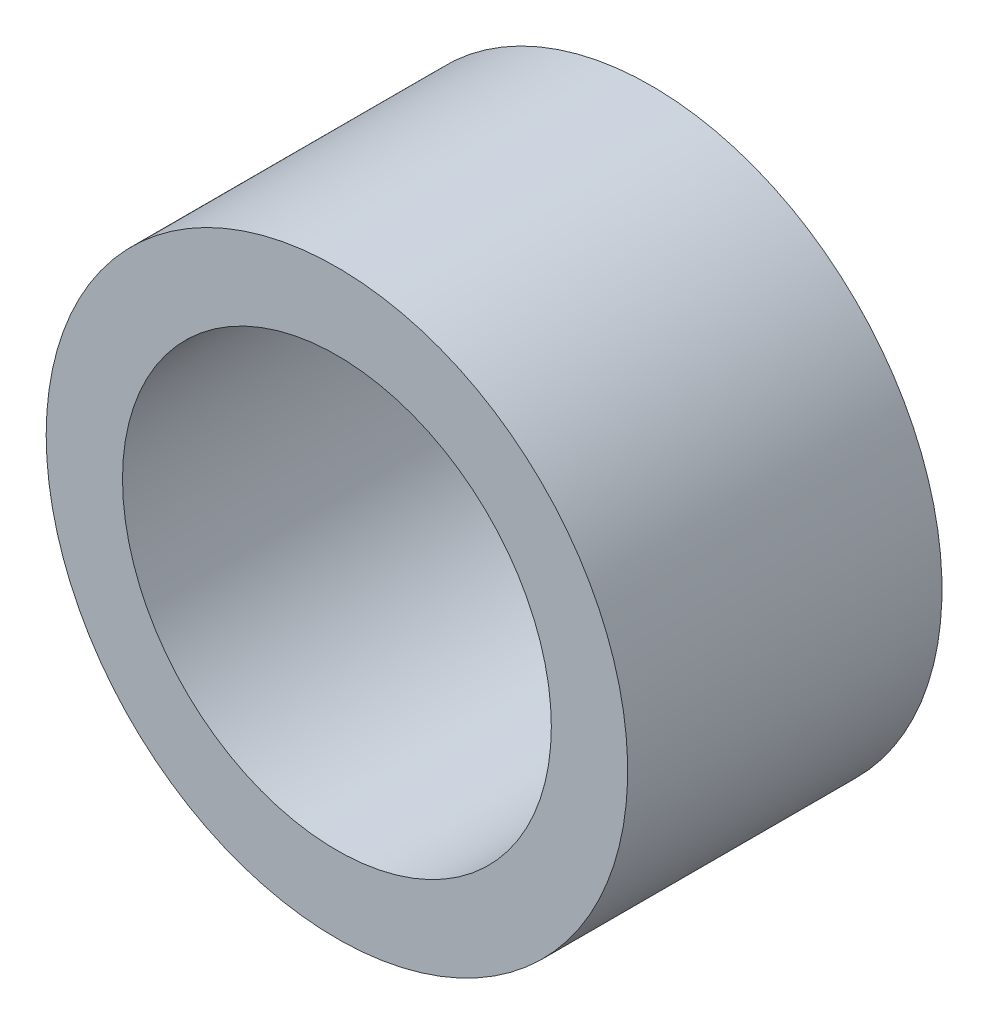
ISO-10303-21;
HEADER;
FILE_DESCRIPTION(('STEP AP214'),'2;1');
FILE_NAME('part.step','',(''),(''),'','','');
FILE_SCHEMA(('AUTOMOTIVE_DESIGN { 1 0 10303 214 1 1 1 1 }'));
ENDSEC;
DATA;
#1=APPLICATION_CONTEXT('core data for automotive mechanical design processes');
#2=APPLICATION_PROTOCOL_DEFINITION('international standard','automotive_design',2000,#1);
#3=PRODUCT_CONTEXT('',#1,'mechanical');
#4=PRODUCT('Part','Part','',(#3));
#5=PRODUCT_RELATED_PRODUCT_CATEGORY('part','',(#4));
#6=PRODUCT_DEFINITION_FORMATION('','',#4);
#7=PRODUCT_DEFINITION_CONTEXT('part definition',#1,'design');
#8=PRODUCT_DEFINITION('design','',#6,#7);
#9=PRODUCT_DEFINITION_SHAPE('','',#8);
#10=(LENGTH_UNIT() NAMED_UNIT(*) SI_UNIT(.MILLI.,.METRE.));
#11=(NAMED_UNIT(*) PLANE_ANGLE_UNIT() SI_UNIT($,.RADIAN.));
#12=(NAMED_UNIT(*) SI_UNIT($,.STERADIAN.) SOLID_ANGLE_UNIT());
#13=UNCERTAINTY_MEASURE_WITH_UNIT(LENGTH_MEASURE(1.E-05),#10,'distance_accuracy_value','');
#14=(GEOMETRIC_REPRESENTATION_CONTEXT(3) GLOBAL_UNCERTAINTY_ASSIGNED_CONTEXT((#13)) GLOBAL_UNIT_ASSIGNED_CONTEXT((#10,
#11,#12)) REPRESENTATION_CONTEXT('',''));
#15=CARTESIAN_POINT('',(0.,0.,0.));
#16=DIRECTION('',(0.,0.,1.));
#17=DIRECTION('',(1.,0.,0.));
#18=AXIS2_PLACEMENT_3D('',#15,#16,#17);
#19=CARTESIAN_POINT('',(0.,0.,7.112));
#20=DIRECTION('',(0.,0.,-1.));
#21=DIRECTION('',(-1.,0.,0.));
#22=AXIS2_PLACEMENT_3D('',#19,#20,#21);
#23=CYLINDRICAL_SURFACE('',#22,4.8514);
#24=CARTESIAN_POINT('',(0.,0.,0.));
#25=DIRECTION('',(0.,0.,-1.));
#26=DIRECTION('',(-1.,0.,0.));
#27=AXIS2_PLACEMENT_3D('',#24,#25,#26);
#28=CIRCLE('',#27,4.8514);
#29=CARTESIAN_POINT('',(-4.8514,0.,0.));
#30=VERTEX_POINT('',#29);
#31=EDGE_CURVE('E26',#30,#30,#28,.T.);
#32=ORIENTED_EDGE('',*,*,#31,.T.);
#33=EDGE_LOOP('',(#32));
#34=FACE_BOUND('',#33,.T.);
#35=CARTESIAN_POINT('',(0.,0.,7.112));
#36=DIRECTION('',(0.,0.,-1.));
#37=DIRECTION('',(-1.,0.,0.));
#38=AXIS2_PLACEMENT_3D('',#35,#36,#37);
#39=CIRCLE('',#38,4.8514);
#40=CARTESIAN_POINT('',(-4.8514,0.,7.112));
#41=VERTEX_POINT('',#40);
#42=EDGE_CURVE('E17',#41,#41,#39,.T.);
#43=ORIENTED_EDGE('',*,*,#42,.F.);
#44=EDGE_LOOP('',(#43));
#45=FACE_BOUND('',#44,.T.);
#46=ADVANCED_FACE('F14',(#34,#45),#23,.F.);
#47=CARTESIAN_POINT('',(0.,0.,7.112));
#48=DIRECTION('',(0.,0.,1.));
#49=DIRECTION('',(1.,0.,0.));
#50=AXIS2_PLACEMENT_3D('',#47,#48,#49);
#51=PLANE('',#50);
#52=ORIENTED_EDGE('',*,*,#42,.T.);
#53=EDGE_LOOP('',(#52));
#54=FACE_BOUND('',#53,.T.);
#55=CARTESIAN_POINT('',(0.,0.,7.112));
#56=DIRECTION('',(0.,0.,-1.));
#57=DIRECTION('',(-1.,0.,0.));
#58=AXIS2_PLACEMENT_3D('',#55,#56,#57);
#59=CIRCLE('',#58,6.5786);
#60=CARTESIAN_POINT('',(-6.5786,0.,7.112));
#61=VERTEX_POINT('',#60);
#62=EDGE_CURVE('E21',#61,#61,#59,.T.);
#63=ORIENTED_EDGE('',*,*,#62,.F.);
#64=EDGE_LOOP('',(#63));
#65=FACE_BOUND('',#64,.T.);
#66=ADVANCED_FACE('F34',(#54,#65),#51,.T.);
#67=CARTESIAN_POINT('',(0.,0.,0.));
#68=DIRECTION('',(0.,0.,1.));
#69=DIRECTION('',(1.,0.,0.));
#70=AXIS2_PLACEMENT_3D('',#67,#68,#69);
#71=PLANE('',#70);
#72=ORIENTED_EDGE('',*,*,#31,.F.);
#73=EDGE_LOOP('',(#72));
#74=FACE_BOUND('',#73,.T.);
#75=CARTESIAN_POINT('',(0.,0.,0.));
#76=DIRECTION('',(0.,0.,-1.));
#77=DIRECTION('',(-1.,0.,0.));
#78=AXIS2_PLACEMENT_3D('',#75,#76,#77);
#79=CIRCLE('',#78,6.5786);
#80=CARTESIAN_POINT('',(-6.5786,0.,0.));
#81=VERTEX_POINT('',#80);
#82=EDGE_CURVE('E10',#81,#81,#79,.F.);
#83=ORIENTED_EDGE('',*,*,#82,.F.);
#84=EDGE_LOOP('',(#83));
#85=FACE_BOUND('',#84,.T.);
#86=ADVANCED_FACE('F42',(#74,#85),#71,.F.);
#87=CARTESIAN_POINT('',(0.,0.,7.112));
#88=DIRECTION('',(0.,0.,-1.));
#89=DIRECTION('',(-1.,0.,0.));
#90=AXIS2_PLACEMENT_3D('',#87,#88,#89);
#91=CYLINDRICAL_SURFACE('',#90,6.5786);
#92=ORIENTED_EDGE('',*,*,#82,.T.);
#93=EDGE_LOOP('',(#92));
#94=FACE_BOUND('',#93,.T.);
#95=ORIENTED_EDGE('',*,*,#62,.T.);
#96=EDGE_LOOP('',(#95));
#97=FACE_BOUND('',#96,.T.);
#98=ADVANCED_FACE('F43',(#94,#97),#91,.T.);
#99=CLOSED_SHELL('',(#46,#66,#86,#98));
#100=MANIFOLD_SOLID_BREP('B1',#99);
#101=ADVANCED_BREP_SHAPE_REPRESENTATION('',(#18,#100),#14);
#102=SHAPE_DEFINITION_REPRESENTATION(#9,#101);
ENDSEC;
END-ISO-10303-21;
